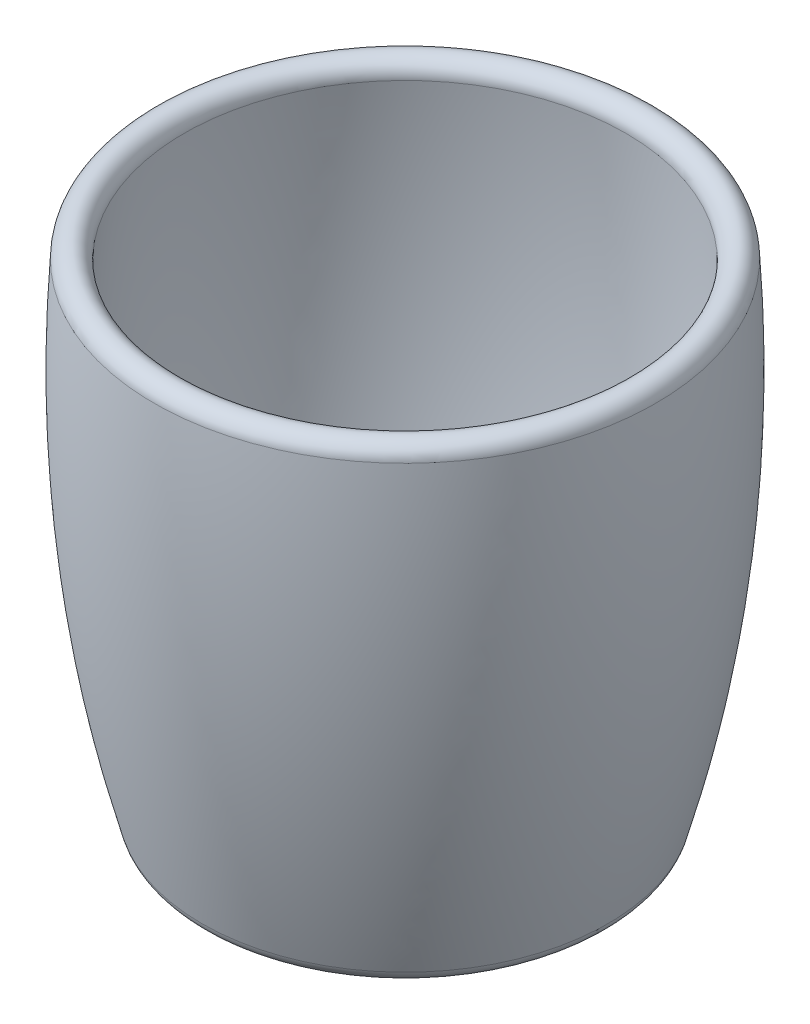
ISO-10303-21;
HEADER;
FILE_DESCRIPTION(('STEP AP214'),'2;1');
FILE_NAME('part.step','',(''),(''),'','','');
FILE_SCHEMA(('AUTOMOTIVE_DESIGN { 1 0 10303 214 1 1 1 1 }'));
ENDSEC;
DATA;
#1=APPLICATION_CONTEXT('core data for automotive mechanical design processes');
#2=APPLICATION_PROTOCOL_DEFINITION('international standard','automotive_design',2000,#1);
#3=PRODUCT_CONTEXT('',#1,'mechanical');
#4=PRODUCT('Part','Part','',(#3));
#5=PRODUCT_RELATED_PRODUCT_CATEGORY('part','',(#4));
#6=PRODUCT_DEFINITION_FORMATION('','',#4);
#7=PRODUCT_DEFINITION_CONTEXT('part definition',#1,'design');
#8=PRODUCT_DEFINITION('design','',#6,#7);
#9=PRODUCT_DEFINITION_SHAPE('','',#8);
#10=(LENGTH_UNIT() NAMED_UNIT(*) SI_UNIT(.MILLI.,.METRE.));
#11=(NAMED_UNIT(*) PLANE_ANGLE_UNIT() SI_UNIT($,.RADIAN.));
#12=(NAMED_UNIT(*) SI_UNIT($,.STERADIAN.) SOLID_ANGLE_UNIT());
#13=UNCERTAINTY_MEASURE_WITH_UNIT(LENGTH_MEASURE(1.E-05),#10,'distance_accuracy_value','');
#14=(GEOMETRIC_REPRESENTATION_CONTEXT(3) GLOBAL_UNCERTAINTY_ASSIGNED_CONTEXT((#13)) GLOBAL_UNIT_ASSIGNED_CONTEXT((#10,
#11,#12)) REPRESENTATION_CONTEXT('',''));
#15=CARTESIAN_POINT('',(0.,0.,0.));
#16=DIRECTION('',(0.,0.,1.));
#17=DIRECTION('',(1.,0.,0.));
#18=AXIS2_PLACEMENT_3D('',#15,#16,#17);
#19=CARTESIAN_POINT('',(0.,5.,0.));
#20=DIRECTION('',(0.,1.,0.));
#21=DIRECTION('',(0.,0.,1.));
#22=AXIS2_PLACEMENT_3D('',#19,#20,#21);
#23=PLANE('',#22);
#24=CARTESIAN_POINT('',(0.,5.,0.));
#25=DIRECTION('',(0.,1.,0.));
#26=DIRECTION('',(0.,0.,1.));
#27=AXIS2_PLACEMENT_3D('',#24,#25,#26);
#28=CIRCLE('',#27,27.1391905027703);
#29=CARTESIAN_POINT('',(0.,5.,27.1391905027703));
#30=VERTEX_POINT('',#29);
#31=EDGE_CURVE('E45',#30,#30,#28,.T.);
#32=ORIENTED_EDGE('',*,*,#31,.T.);
#33=EDGE_LOOP('',(#32));
#34=FACE_BOUND('',#33,.T.);
#35=ADVANCED_FACE('F34',(#34),#23,.T.);
#36=CARTESIAN_POINT('',(36.8601264484739,81.0819403518509,0.));
#37=CARTESIAN_POINT('',(37.06783674226,77.823280828789,0.));
#38=CARTESIAN_POINT('',(37.3573213885304,71.2744584432907,0.));
#39=CARTESIAN_POINT('',(37.4144319666475,58.3463548968909,0.));
#40=CARTESIAN_POINT('',(36.5162777397363,42.3627053961325,0.));
#41=CARTESIAN_POINT('',(33.8900650254874,23.5134670461146,0.));
#42=CARTESIAN_POINT('',(31.0987213312191,11.1227311945635,0.));
#43=CARTESIAN_POINT('',(29.4504231524279,5.,0.));
#44=B_SPLINE_CURVE_WITH_KNOTS('',3,(#36,#37,#38,#39,#40,#41,#42,#43),.UNSPECIFIED.,.F.,.F.,(4,1,
1,1,1,4),(0.0469513690142023,0.166082447887427,0.285213526760652,0.523475684507101,
0.761737842253551,1.),.UNSPECIFIED.);
#45=CARTESIAN_POINT('',(0.,0.,0.));
#46=DIRECTION('',(0.,-1.,0.));
#47=AXIS1_PLACEMENT('',#45,#46);
#48=SURFACE_OF_REVOLUTION('',#44,#47);
#49=CARTESIAN_POINT('',(0.,7.24953979930395,0.));
#50=DIRECTION('',(0.,-1.,0.));
#51=DIRECTION('',(0.,0.,-1.));
#52=AXIS2_PLACEMENT_3D('',#49,#50,#51);
#53=CIRCLE('',#52,30.0438091502302);
#54=CARTESIAN_POINT('',(0.,7.24953979930395,-30.0438091502302));
#55=VERTEX_POINT('',#54);
#56=EDGE_CURVE('E49',#55,#55,#53,.T.);
#57=ORIENTED_EDGE('',*,*,#56,.T.);
#58=EDGE_LOOP('',(#57));
#59=FACE_BOUND('',#58,.T.);
#60=CARTESIAN_POINT('',(0.,81.0819403518509,0.));
#61=DIRECTION('',(0.,-1.,0.));
#62=DIRECTION('',(0.,0.,-1.));
#63=AXIS2_PLACEMENT_3D('',#60,#61,#62);
#64=CIRCLE('',#63,36.8601264484739);
#65=CARTESIAN_POINT('',(0.,81.0819403518509,-36.8601264484739));
#66=VERTEX_POINT('',#65);
#67=EDGE_CURVE('E54',#66,#66,#64,.T.);
#68=ORIENTED_EDGE('',*,*,#67,.F.);
#69=EDGE_LOOP('',(#68));
#70=FACE_BOUND('',#69,.T.);
#71=ADVANCED_FACE('F71',(#59,#70),#48,.F.);
#72=CARTESIAN_POINT('',(0.,81.2409701759254,0.));
#73=DIRECTION('',(0.,-1.,0.));
#74=DIRECTION('',(0.,0.,-1.));
#75=AXIS2_PLACEMENT_3D('',#72,#73,#74);
#76=TOROIDAL_SURFACE('',#75,39.355063224237,2.5);
#77=ORIENTED_EDGE('',*,*,#67,.T.);
#78=EDGE_LOOP('',(#77));
#79=FACE_BOUND('',#78,.T.);
#80=CARTESIAN_POINT('',(0.,81.4,0.));
#81=DIRECTION('',(0.,-1.,0.));
#82=DIRECTION('',(0.,0.,-1.));
#83=AXIS2_PLACEMENT_3D('',#80,#81,#82);
#84=CIRCLE('',#83,41.85);
#85=CARTESIAN_POINT('',(0.,81.4,-41.85));
#86=VERTEX_POINT('',#85);
#87=EDGE_CURVE('E57',#86,#86,#84,.T.);
#88=ORIENTED_EDGE('',*,*,#87,.F.);
#89=EDGE_LOOP('',(#88));
#90=FACE_BOUND('',#89,.T.);
#91=ADVANCED_FACE('F75',(#79,#90),#76,.T.);
#92=CARTESIAN_POINT('',(33.25,0.,0.));
#93=CARTESIAN_POINT('',(40.7705850821435,26.2273970416013,0.));
#94=CARTESIAN_POINT('',(43.6372517488102,53.3607303749346,0.));
#95=CARTESIAN_POINT('',(41.85,81.4,0.));
#96=B_SPLINE_CURVE_WITH_KNOTS('',3,(#92,#93,#94,#95),.UNSPECIFIED.,.F.,.F.,(4,4),(0.,1.),.UNSPECIFIED.);
#97=CARTESIAN_POINT('',(0.,0.,0.));
#98=DIRECTION('',(0.,-1.,0.));
#99=AXIS1_PLACEMENT('',#97,#98);
#100=SURFACE_OF_REVOLUTION('',#96,#99);
#101=CARTESIAN_POINT('',(0.,2.20105279567939,0.));
#102=DIRECTION('',(0.,-1.,0.));
#103=DIRECTION('',(0.,0.,-1.));
#104=AXIS2_PLACEMENT_3D('',#101,#102,#103);
#105=CIRCLE('',#104,33.8696284522718);
#106=CARTESIAN_POINT('',(0.,2.20105279567939,-33.8696284522718));
#107=VERTEX_POINT('',#106);
#108=EDGE_CURVE('E10',#107,#107,#105,.F.);
#109=ORIENTED_EDGE('',*,*,#108,.T.);
#110=EDGE_LOOP('',(#109));
#111=FACE_BOUND('',#110,.T.);
#112=ORIENTED_EDGE('',*,*,#87,.T.);
#113=EDGE_LOOP('',(#112));
#114=FACE_BOUND('',#113,.T.);
#115=ADVANCED_FACE('F89',(#111,#114),#100,.F.);
#116=CARTESIAN_POINT('',(0.,0.,0.));
#117=DIRECTION('',(0.,-1.,0.));
#118=DIRECTION('',(0.,0.,-1.));
#119=AXIS2_PLACEMENT_3D('',#116,#117,#118);
#120=PLANE('',#119);
#121=CARTESIAN_POINT('',(0.,0.,0.));
#122=DIRECTION('',(0.,-1.,0.));
#123=DIRECTION('',(0.,0.,-1.));
#124=AXIS2_PLACEMENT_3D('',#121,#122,#123);
#125=CIRCLE('',#124,30.977970906035);
#126=CARTESIAN_POINT('',(0.,0.,-30.977970906035));
#127=VERTEX_POINT('',#126);
#128=EDGE_CURVE('E41',#127,#127,#125,.T.);
#129=ORIENTED_EDGE('',*,*,#128,.T.);
#130=EDGE_LOOP('',(#129));
#131=FACE_BOUND('',#130,.T.);
#132=ADVANCED_FACE('F82',(#131),#120,.T.);
#133=CARTESIAN_POINT('',(0.,8.,0.));
#134=DIRECTION('',(0.,-1.,0.));
#135=DIRECTION('',(0.,0.,-1.));
#136=AXIS2_PLACEMENT_3D('',#133,#134,#135);
#137=TOROIDAL_SURFACE('',#136,27.1391905027703,3.);
#138=ORIENTED_EDGE('',*,*,#31,.F.);
#139=EDGE_LOOP('',(#138));
#140=FACE_BOUND('',#139,.T.);
#141=ORIENTED_EDGE('',*,*,#56,.F.);
#142=EDGE_LOOP('',(#141));
#143=FACE_BOUND('',#142,.T.);
#144=ADVANCED_FACE('F80',(#140,#143),#137,.F.);
#145=CARTESIAN_POINT('',(0.,3.,0.));
#146=DIRECTION('',(0.,-1.,0.));
#147=DIRECTION('',(0.,0.,-1.));
#148=AXIS2_PLACEMENT_3D('',#145,#146,#147);
#149=TOROIDAL_SURFACE('',#148,30.977970906035,3.);
#150=ORIENTED_EDGE('',*,*,#108,.F.);
#151=EDGE_LOOP('',(#150));
#152=FACE_BOUND('',#151,.T.);
#153=ORIENTED_EDGE('',*,*,#128,.F.);
#154=EDGE_LOOP('',(#153));
#155=FACE_BOUND('',#154,.T.);
#156=ADVANCED_FACE('F36',(#152,#155),#149,.T.);
#157=CLOSED_SHELL('',(#35,#71,#91,#115,#132,#144,#156));
#158=MANIFOLD_SOLID_BREP('B2',#157);
#159=ADVANCED_BREP_SHAPE_REPRESENTATION('',(#18,#158),#14);
#160=SHAPE_DEFINITION_REPRESENTATION(#9,#159);
ENDSEC;
END-ISO-10303-21;
